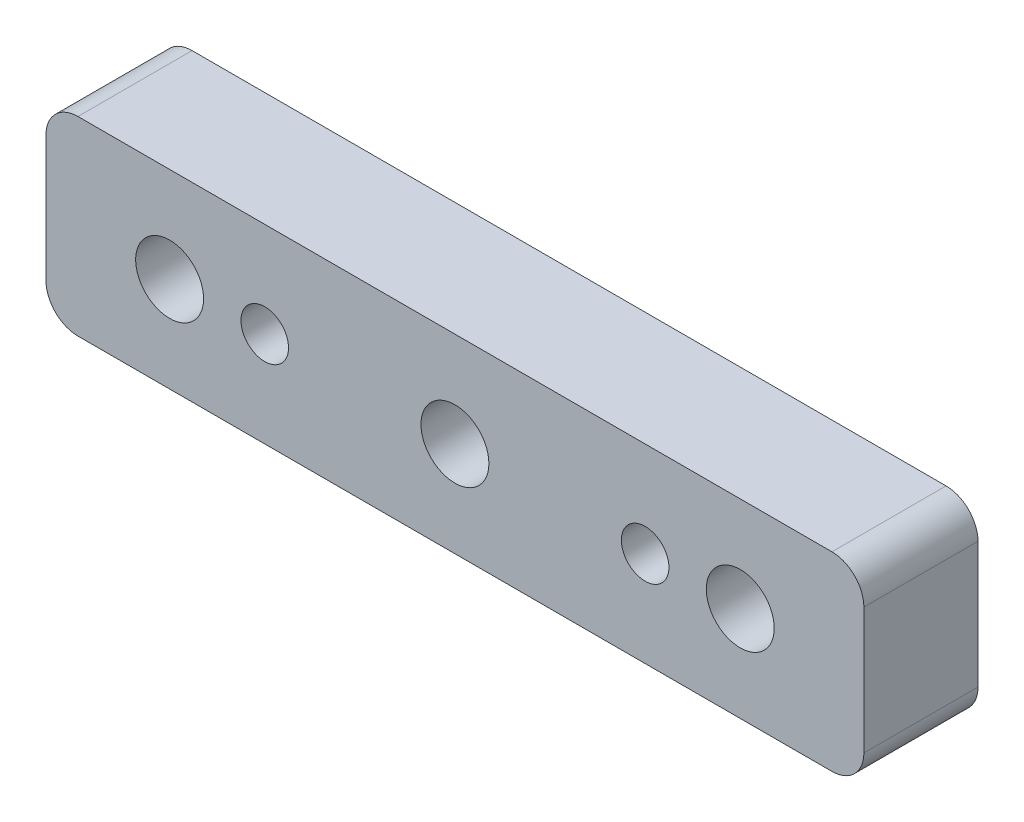
ISO-10303-21;
HEADER;
FILE_DESCRIPTION(('STEP AP214'),'2;1');
FILE_NAME('part.step','',(''),(''),'','','');
FILE_SCHEMA(('AUTOMOTIVE_DESIGN { 1 0 10303 214 1 1 1 1 }'));
ENDSEC;
DATA;
#1=APPLICATION_CONTEXT('core data for automotive mechanical design processes');
#2=APPLICATION_PROTOCOL_DEFINITION('international standard','automotive_design',2000,#1);
#3=PRODUCT_CONTEXT('',#1,'mechanical');
#4=PRODUCT('Part','Part','',(#3));
#5=PRODUCT_RELATED_PRODUCT_CATEGORY('part','',(#4));
#6=PRODUCT_DEFINITION_FORMATION('','',#4);
#7=PRODUCT_DEFINITION_CONTEXT('part definition',#1,'design');
#8=PRODUCT_DEFINITION('design','',#6,#7);
#9=PRODUCT_DEFINITION_SHAPE('','',#8);
#10=(LENGTH_UNIT() NAMED_UNIT(*) SI_UNIT(.MILLI.,.METRE.));
#11=(NAMED_UNIT(*) PLANE_ANGLE_UNIT() SI_UNIT($,.RADIAN.));
#12=(NAMED_UNIT(*) SI_UNIT($,.STERADIAN.) SOLID_ANGLE_UNIT());
#13=UNCERTAINTY_MEASURE_WITH_UNIT(LENGTH_MEASURE(1.E-05),#10,'distance_accuracy_value','');
#14=(GEOMETRIC_REPRESENTATION_CONTEXT(3) GLOBAL_UNCERTAINTY_ASSIGNED_CONTEXT((#13)) GLOBAL_UNIT_ASSIGNED_CONTEXT((#10,
#11,#12)) REPRESENTATION_CONTEXT('',''));
#15=CARTESIAN_POINT('',(0.,0.,0.));
#16=DIRECTION('',(0.,0.,1.));
#17=DIRECTION('',(1.,0.,0.));
#18=AXIS2_PLACEMENT_3D('',#15,#16,#17);
#19=CARTESIAN_POINT('',(39.64,6.64,6.));
#20=DIRECTION('',(0.,0.,-1.));
#21=DIRECTION('',(-1.,0.,0.));
#22=AXIS2_PLACEMENT_3D('',#19,#20,#21);
#23=PLANE('',#22);
#24=CARTESIAN_POINT('',(-20.,0.,6.));
#25=DIRECTION('',(0.,0.,1.));
#26=DIRECTION('',(1.,0.,0.));
#27=AXIS2_PLACEMENT_3D('',#24,#25,#26);
#28=CIRCLE('',#27,2.5);
#29=CARTESIAN_POINT('',(-17.5,0.,6.));
#30=VERTEX_POINT('',#29);
#31=EDGE_CURVE('E193',#30,#30,#28,.T.);
#32=ORIENTED_EDGE('',*,*,#31,.F.);
#33=EDGE_LOOP('',(#32));
#34=FACE_BOUND('',#33,.T.);
#35=CARTESIAN_POINT('',(0.,0.,6.));
#36=DIRECTION('',(0.,0.,1.));
#37=DIRECTION('',(1.,0.,0.));
#38=AXIS2_PLACEMENT_3D('',#35,#36,#37);
#39=CIRCLE('',#38,3.57);
#40=CARTESIAN_POINT('',(3.57,0.,6.));
#41=VERTEX_POINT('',#40);
#42=EDGE_CURVE('E181',#41,#41,#39,.T.);
#43=ORIENTED_EDGE('',*,*,#42,.F.);
#44=EDGE_LOOP('',(#43));
#45=FACE_BOUND('',#44,.T.);
#46=CARTESIAN_POINT('',(39.64,6.64,6.));
#47=DIRECTION('',(0.,0.,1.));
#48=DIRECTION('',(-1.,0.,0.));
#49=AXIS2_PLACEMENT_3D('',#46,#47,#48);
#50=CIRCLE('',#49,3.36);
#51=CARTESIAN_POINT('',(43.,6.63999999999998,6.));
#52=VERTEX_POINT('',#51);
#53=CARTESIAN_POINT('',(39.64,10.,6.));
#54=VERTEX_POINT('',#53);
#55=EDGE_CURVE('E144',#52,#54,#50,.T.);
#56=ORIENTED_EDGE('',*,*,#55,.T.);
#57=DIRECTION('',(-1.,0.,0.));
#58=VECTOR('',#57,1.);
#59=CARTESIAN_POINT('',(-39.64,10.,6.));
#60=LINE('',#59,#58);
#61=CARTESIAN_POINT('',(-39.64,10.,6.));
#62=VERTEX_POINT('',#61);
#63=EDGE_CURVE('E92',#54,#62,#60,.T.);
#64=ORIENTED_EDGE('',*,*,#63,.T.);
#65=CARTESIAN_POINT('',(-39.64,6.64,6.));
#66=DIRECTION('',(0.,0.,1.));
#67=DIRECTION('',(-1.,0.,0.));
#68=AXIS2_PLACEMENT_3D('',#65,#66,#67);
#69=CIRCLE('',#68,3.36);
#70=CARTESIAN_POINT('',(-43.,6.63999999999998,6.));
#71=VERTEX_POINT('',#70);
#72=EDGE_CURVE('E159',#62,#71,#69,.T.);
#73=ORIENTED_EDGE('',*,*,#72,.T.);
#74=DIRECTION('',(0.,-1.,0.));
#75=VECTOR('',#74,1.);
#76=CARTESIAN_POINT('',(-43.,-6.63999999999998,6.));
#77=LINE('',#76,#75);
#78=CARTESIAN_POINT('',(-43.,-6.63999999999998,6.));
#79=VERTEX_POINT('',#78);
#80=EDGE_CURVE('E172',#71,#79,#77,.T.);
#81=ORIENTED_EDGE('',*,*,#80,.T.);
#82=CARTESIAN_POINT('',(-39.64,-6.64,6.));
#83=DIRECTION('',(0.,0.,1.));
#84=DIRECTION('',(-1.,0.,0.));
#85=AXIS2_PLACEMENT_3D('',#82,#83,#84);
#86=CIRCLE('',#85,3.36);
#87=CARTESIAN_POINT('',(-39.64,-10.,6.));
#88=VERTEX_POINT('',#87);
#89=EDGE_CURVE('E111',#79,#88,#86,.T.);
#90=ORIENTED_EDGE('',*,*,#89,.T.);
#91=DIRECTION('',(1.,0.,0.));
#92=VECTOR('',#91,1.);
#93=CARTESIAN_POINT('',(-39.64,-10.,6.));
#94=LINE('',#93,#92);
#95=CARTESIAN_POINT('',(39.64,-10.,6.));
#96=VERTEX_POINT('',#95);
#97=EDGE_CURVE('E105',#88,#96,#94,.T.);
#98=ORIENTED_EDGE('',*,*,#97,.T.);
#99=CARTESIAN_POINT('',(39.64,-6.64,6.));
#100=DIRECTION('',(0.,0.,1.));
#101=DIRECTION('',(1.,0.,0.));
#102=AXIS2_PLACEMENT_3D('',#99,#100,#101);
#103=CIRCLE('',#102,3.36);
#104=CARTESIAN_POINT('',(43.,-6.63999999999998,6.));
#105=VERTEX_POINT('',#104);
#106=EDGE_CURVE('E109',#96,#105,#103,.T.);
#107=ORIENTED_EDGE('',*,*,#106,.T.);
#108=DIRECTION('',(0.,1.,0.));
#109=VECTOR('',#108,1.);
#110=CARTESIAN_POINT('',(43.,-6.63999999999998,6.));
#111=LINE('',#110,#109);
#112=EDGE_CURVE('E49',#105,#52,#111,.T.);
#113=ORIENTED_EDGE('',*,*,#112,.T.);
#114=EDGE_LOOP('',(#56,#64,#73,#81,#90,#98,#107,#113));
#115=FACE_BOUND('',#114,.T.);
#116=CARTESIAN_POINT('',(-30.,0.,6.));
#117=DIRECTION('',(0.,0.,1.));
#118=DIRECTION('',(1.,0.,0.));
#119=AXIS2_PLACEMENT_3D('',#116,#117,#118);
#120=CIRCLE('',#119,3.57);
#121=CARTESIAN_POINT('',(-26.43,0.,6.));
#122=VERTEX_POINT('',#121);
#123=EDGE_CURVE('E133',#122,#122,#120,.T.);
#124=ORIENTED_EDGE('',*,*,#123,.F.);
#125=EDGE_LOOP('',(#124));
#126=FACE_BOUND('',#125,.T.);
#127=CARTESIAN_POINT('',(30.,0.,6.));
#128=DIRECTION('',(0.,0.,1.));
#129=DIRECTION('',(1.,0.,0.));
#130=AXIS2_PLACEMENT_3D('',#127,#128,#129);
#131=CIRCLE('',#130,3.57);
#132=CARTESIAN_POINT('',(33.57,0.,6.));
#133=VERTEX_POINT('',#132);
#134=EDGE_CURVE('E187',#133,#133,#131,.T.);
#135=ORIENTED_EDGE('',*,*,#134,.F.);
#136=EDGE_LOOP('',(#135));
#137=FACE_BOUND('',#136,.T.);
#138=CARTESIAN_POINT('',(20.,0.,6.));
#139=DIRECTION('',(0.,0.,1.));
#140=DIRECTION('',(1.,0.,0.));
#141=AXIS2_PLACEMENT_3D('',#138,#139,#140);
#142=CIRCLE('',#141,2.5);
#143=CARTESIAN_POINT('',(22.5,0.,6.));
#144=VERTEX_POINT('',#143);
#145=EDGE_CURVE('E199',#144,#144,#142,.T.);
#146=ORIENTED_EDGE('',*,*,#145,.F.);
#147=EDGE_LOOP('',(#146));
#148=FACE_BOUND('',#147,.T.);
#149=ADVANCED_FACE('F32',(#34,#45,#115,#126,#137,#148),#23,.F.);
#150=CARTESIAN_POINT('',(39.64,6.64,-6.));
#151=DIRECTION('',(0.,0.,-1.));
#152=DIRECTION('',(-1.,0.,0.));
#153=AXIS2_PLACEMENT_3D('',#150,#151,#152);
#154=PLANE('',#153);
#155=CARTESIAN_POINT('',(-20.,0.,-6.));
#156=DIRECTION('',(0.,0.,1.));
#157=DIRECTION('',(1.,0.,0.));
#158=AXIS2_PLACEMENT_3D('',#155,#156,#157);
#159=CIRCLE('',#158,2.5);
#160=CARTESIAN_POINT('',(-17.5,0.,-6.));
#161=VERTEX_POINT('',#160);
#162=EDGE_CURVE('E196',#161,#161,#159,.T.);
#163=ORIENTED_EDGE('',*,*,#162,.T.);
#164=EDGE_LOOP('',(#163));
#165=FACE_BOUND('',#164,.T.);
#166=CARTESIAN_POINT('',(0.,0.,-6.));
#167=DIRECTION('',(0.,0.,1.));
#168=DIRECTION('',(1.,0.,0.));
#169=AXIS2_PLACEMENT_3D('',#166,#167,#168);
#170=CIRCLE('',#169,3.57);
#171=CARTESIAN_POINT('',(3.57,0.,-6.));
#172=VERTEX_POINT('',#171);
#173=EDGE_CURVE('E184',#172,#172,#170,.T.);
#174=ORIENTED_EDGE('',*,*,#173,.T.);
#175=EDGE_LOOP('',(#174));
#176=FACE_BOUND('',#175,.T.);
#177=CARTESIAN_POINT('',(39.64,6.64,-6.));
#178=DIRECTION('',(0.,0.,1.));
#179=DIRECTION('',(-1.,0.,0.));
#180=AXIS2_PLACEMENT_3D('',#177,#178,#179);
#181=CIRCLE('',#180,3.36);
#182=CARTESIAN_POINT('',(43.,6.63999999999998,-6.));
#183=VERTEX_POINT('',#182);
#184=CARTESIAN_POINT('',(39.64,10.,-6.));
#185=VERTEX_POINT('',#184);
#186=EDGE_CURVE('E129',#183,#185,#181,.T.);
#187=ORIENTED_EDGE('',*,*,#186,.F.);
#188=DIRECTION('',(0.,1.,0.));
#189=VECTOR('',#188,1.);
#190=CARTESIAN_POINT('',(43.,-6.63999999999998,-6.));
#191=LINE('',#190,#189);
#192=CARTESIAN_POINT('',(43.,-6.63999999999998,-6.));
#193=VERTEX_POINT('',#192);
#194=EDGE_CURVE('E84',#193,#183,#191,.T.);
#195=ORIENTED_EDGE('',*,*,#194,.F.);
#196=CARTESIAN_POINT('',(39.64,-6.64,-6.));
#197=DIRECTION('',(0.,0.,1.));
#198=DIRECTION('',(1.,0.,0.));
#199=AXIS2_PLACEMENT_3D('',#196,#197,#198);
#200=CIRCLE('',#199,3.36);
#201=CARTESIAN_POINT('',(39.64,-10.,-6.));
#202=VERTEX_POINT('',#201);
#203=EDGE_CURVE('E78',#202,#193,#200,.T.);
#204=ORIENTED_EDGE('',*,*,#203,.F.);
#205=DIRECTION('',(1.,0.,0.));
#206=VECTOR('',#205,1.);
#207=CARTESIAN_POINT('',(-39.64,-10.,-6.));
#208=LINE('',#207,#206);
#209=CARTESIAN_POINT('',(-39.64,-10.,-6.));
#210=VERTEX_POINT('',#209);
#211=EDGE_CURVE('E119',#210,#202,#208,.T.);
#212=ORIENTED_EDGE('',*,*,#211,.F.);
#213=CARTESIAN_POINT('',(-39.64,-6.64,-6.));
#214=DIRECTION('',(0.,0.,1.));
#215=DIRECTION('',(-1.,0.,0.));
#216=AXIS2_PLACEMENT_3D('',#213,#214,#215);
#217=CIRCLE('',#216,3.36);
#218=CARTESIAN_POINT('',(-43.,-6.63999999999998,-6.));
#219=VERTEX_POINT('',#218);
#220=EDGE_CURVE('E139',#219,#210,#217,.T.);
#221=ORIENTED_EDGE('',*,*,#220,.F.);
#222=DIRECTION('',(0.,-1.,0.));
#223=VECTOR('',#222,1.);
#224=CARTESIAN_POINT('',(-43.,-6.63999999999998,-6.));
#225=LINE('',#224,#223);
#226=CARTESIAN_POINT('',(-43.,6.63999999999998,-6.));
#227=VERTEX_POINT('',#226);
#228=EDGE_CURVE('E137',#227,#219,#225,.T.);
#229=ORIENTED_EDGE('',*,*,#228,.F.);
#230=CARTESIAN_POINT('',(-39.64,6.64,-6.));
#231=DIRECTION('',(0.,0.,1.));
#232=DIRECTION('',(-1.,0.,0.));
#233=AXIS2_PLACEMENT_3D('',#230,#231,#232);
#234=CIRCLE('',#233,3.36);
#235=CARTESIAN_POINT('',(-39.64,10.,-6.));
#236=VERTEX_POINT('',#235);
#237=EDGE_CURVE('E135',#236,#227,#234,.T.);
#238=ORIENTED_EDGE('',*,*,#237,.F.);
#239=DIRECTION('',(-1.,0.,0.));
#240=VECTOR('',#239,1.);
#241=CARTESIAN_POINT('',(-39.64,10.,-6.));
#242=LINE('',#241,#240);
#243=EDGE_CURVE('E132',#185,#236,#242,.T.);
#244=ORIENTED_EDGE('',*,*,#243,.F.);
#245=EDGE_LOOP('',(#187,#195,#204,#212,#221,#229,#238,#244));
#246=FACE_BOUND('',#245,.T.);
#247=CARTESIAN_POINT('',(-30.,0.,-6.));
#248=DIRECTION('',(0.,0.,1.));
#249=DIRECTION('',(1.,0.,0.));
#250=AXIS2_PLACEMENT_3D('',#247,#248,#249);
#251=CIRCLE('',#250,3.57);
#252=CARTESIAN_POINT('',(-26.43,0.,-6.));
#253=VERTEX_POINT('',#252);
#254=EDGE_CURVE('E178',#253,#253,#251,.T.);
#255=ORIENTED_EDGE('',*,*,#254,.T.);
#256=EDGE_LOOP('',(#255));
#257=FACE_BOUND('',#256,.T.);
#258=CARTESIAN_POINT('',(30.,0.,-6.));
#259=DIRECTION('',(0.,0.,1.));
#260=DIRECTION('',(1.,0.,0.));
#261=AXIS2_PLACEMENT_3D('',#258,#259,#260);
#262=CIRCLE('',#261,3.57);
#263=CARTESIAN_POINT('',(33.57,0.,-6.));
#264=VERTEX_POINT('',#263);
#265=EDGE_CURVE('E190',#264,#264,#262,.T.);
#266=ORIENTED_EDGE('',*,*,#265,.T.);
#267=EDGE_LOOP('',(#266));
#268=FACE_BOUND('',#267,.T.);
#269=CARTESIAN_POINT('',(20.,0.,-6.));
#270=DIRECTION('',(0.,0.,1.));
#271=DIRECTION('',(1.,0.,0.));
#272=AXIS2_PLACEMENT_3D('',#269,#270,#271);
#273=CIRCLE('',#272,2.5);
#274=CARTESIAN_POINT('',(22.5,0.,-6.));
#275=VERTEX_POINT('',#274);
#276=EDGE_CURVE('E202',#275,#275,#273,.T.);
#277=ORIENTED_EDGE('',*,*,#276,.T.);
#278=EDGE_LOOP('',(#277));
#279=FACE_BOUND('',#278,.T.);
#280=ADVANCED_FACE('F163',(#165,#176,#246,#257,#268,#279),#154,.T.);
#281=CARTESIAN_POINT('',(39.64,6.64,6.));
#282=DIRECTION('',(0.,0.,-1.));
#283=DIRECTION('',(-1.,0.,0.));
#284=AXIS2_PLACEMENT_3D('',#281,#282,#283);
#285=CYLINDRICAL_SURFACE('',#284,3.36);
#286=ORIENTED_EDGE('',*,*,#186,.T.);
#287=DIRECTION('',(0.,0.,-1.));
#288=VECTOR('',#287,1.);
#289=CARTESIAN_POINT('',(39.64,10.,6.));
#290=LINE('',#289,#288);
#291=EDGE_CURVE('E11',#54,#185,#290,.T.);
#292=ORIENTED_EDGE('',*,*,#291,.F.);
#293=ORIENTED_EDGE('',*,*,#55,.F.);
#294=DIRECTION('',(0.,0.,-1.));
#295=VECTOR('',#294,1.);
#296=CARTESIAN_POINT('',(43.,6.63999999999998,6.));
#297=LINE('',#296,#295);
#298=EDGE_CURVE('E125',#52,#183,#297,.T.);
#299=ORIENTED_EDGE('',*,*,#298,.T.);
#300=EDGE_LOOP('',(#286,#292,#293,#299));
#301=FACE_BOUND('',#300,.T.);
#302=ADVANCED_FACE('F34',(#301),#285,.T.);
#303=CARTESIAN_POINT('',(-39.64,10.,6.));
#304=DIRECTION('',(0.,-1.,0.));
#305=DIRECTION('',(0.,0.,-1.));
#306=AXIS2_PLACEMENT_3D('',#303,#304,#305);
#307=PLANE('',#306);
#308=ORIENTED_EDGE('',*,*,#243,.T.);
#309=DIRECTION('',(0.,0.,-1.));
#310=VECTOR('',#309,1.);
#311=CARTESIAN_POINT('',(-39.64,10.,6.));
#312=LINE('',#311,#310);
#313=EDGE_CURVE('E41',#62,#236,#312,.T.);
#314=ORIENTED_EDGE('',*,*,#313,.F.);
#315=ORIENTED_EDGE('',*,*,#63,.F.);
#316=ORIENTED_EDGE('',*,*,#291,.T.);
#317=EDGE_LOOP('',(#308,#314,#315,#316));
#318=FACE_BOUND('',#317,.T.);
#319=ADVANCED_FACE('F237',(#318),#307,.F.);
#320=CARTESIAN_POINT('',(-39.64,6.64,6.));
#321=DIRECTION('',(0.,0.,-1.));
#322=DIRECTION('',(-1.,0.,0.));
#323=AXIS2_PLACEMENT_3D('',#320,#321,#322);
#324=CYLINDRICAL_SURFACE('',#323,3.36);
#325=ORIENTED_EDGE('',*,*,#237,.T.);
#326=DIRECTION('',(0.,0.,-1.));
#327=VECTOR('',#326,1.);
#328=CARTESIAN_POINT('',(-43.,6.63999999999998,6.));
#329=LINE('',#328,#327);
#330=EDGE_CURVE('E151',#71,#227,#329,.T.);
#331=ORIENTED_EDGE('',*,*,#330,.F.);
#332=ORIENTED_EDGE('',*,*,#72,.F.);
#333=ORIENTED_EDGE('',*,*,#313,.T.);
#334=EDGE_LOOP('',(#325,#331,#332,#333));
#335=FACE_BOUND('',#334,.T.);
#336=ADVANCED_FACE('F157',(#335),#324,.T.);
#337=CARTESIAN_POINT('',(-43.,-6.63999999999998,6.));
#338=DIRECTION('',(1.,0.,0.));
#339=DIRECTION('',(0.,0.,-1.));
#340=AXIS2_PLACEMENT_3D('',#337,#338,#339);
#341=PLANE('',#340);
#342=ORIENTED_EDGE('',*,*,#228,.T.);
#343=DIRECTION('',(0.,0.,-1.));
#344=VECTOR('',#343,1.);
#345=CARTESIAN_POINT('',(-43.,-6.63999999999998,6.));
#346=LINE('',#345,#344);
#347=EDGE_CURVE('E148',#79,#219,#346,.T.);
#348=ORIENTED_EDGE('',*,*,#347,.F.);
#349=ORIENTED_EDGE('',*,*,#80,.F.);
#350=ORIENTED_EDGE('',*,*,#330,.T.);
#351=EDGE_LOOP('',(#342,#348,#349,#350));
#352=FACE_BOUND('',#351,.T.);
#353=ADVANCED_FACE('F168',(#352),#341,.F.);
#354=CARTESIAN_POINT('',(-39.64,-6.64,6.));
#355=DIRECTION('',(0.,0.,-1.));
#356=DIRECTION('',(-1.,0.,0.));
#357=AXIS2_PLACEMENT_3D('',#354,#355,#356);
#358=CYLINDRICAL_SURFACE('',#357,3.36);
#359=ORIENTED_EDGE('',*,*,#220,.T.);
#360=DIRECTION('',(0.,0.,-1.));
#361=VECTOR('',#360,1.);
#362=CARTESIAN_POINT('',(-39.64,-10.,6.));
#363=LINE('',#362,#361);
#364=EDGE_CURVE('E120',#88,#210,#363,.T.);
#365=ORIENTED_EDGE('',*,*,#364,.F.);
#366=ORIENTED_EDGE('',*,*,#89,.F.);
#367=ORIENTED_EDGE('',*,*,#347,.T.);
#368=EDGE_LOOP('',(#359,#365,#366,#367));
#369=FACE_BOUND('',#368,.T.);
#370=ADVANCED_FACE('F171',(#369),#358,.T.);
#371=CARTESIAN_POINT('',(-39.64,-10.,6.));
#372=DIRECTION('',(0.,1.,0.));
#373=DIRECTION('',(0.,0.,1.));
#374=AXIS2_PLACEMENT_3D('',#371,#372,#373);
#375=PLANE('',#374);
#376=ORIENTED_EDGE('',*,*,#211,.T.);
#377=DIRECTION('',(0.,0.,-1.));
#378=VECTOR('',#377,1.);
#379=CARTESIAN_POINT('',(39.64,-10.,6.));
#380=LINE('',#379,#378);
#381=EDGE_CURVE('E116',#96,#202,#380,.T.);
#382=ORIENTED_EDGE('',*,*,#381,.F.);
#383=ORIENTED_EDGE('',*,*,#97,.F.);
#384=ORIENTED_EDGE('',*,*,#364,.T.);
#385=EDGE_LOOP('',(#376,#382,#383,#384));
#386=FACE_BOUND('',#385,.T.);
#387=ADVANCED_FACE('F117',(#386),#375,.F.);
#388=CARTESIAN_POINT('',(39.64,-6.64,6.));
#389=DIRECTION('',(0.,0.,-1.));
#390=DIRECTION('',(-1.,0.,0.));
#391=AXIS2_PLACEMENT_3D('',#388,#389,#390);
#392=CYLINDRICAL_SURFACE('',#391,3.36);
#393=ORIENTED_EDGE('',*,*,#203,.T.);
#394=DIRECTION('',(0.,0.,-1.));
#395=VECTOR('',#394,1.);
#396=CARTESIAN_POINT('',(43.,-6.63999999999998,6.));
#397=LINE('',#396,#395);
#398=EDGE_CURVE('E121',#105,#193,#397,.T.);
#399=ORIENTED_EDGE('',*,*,#398,.F.);
#400=ORIENTED_EDGE('',*,*,#106,.F.);
#401=ORIENTED_EDGE('',*,*,#381,.T.);
#402=EDGE_LOOP('',(#393,#399,#400,#401));
#403=FACE_BOUND('',#402,.T.);
#404=ADVANCED_FACE('F123',(#403),#392,.T.);
#405=CARTESIAN_POINT('',(43.,-6.63999999999998,6.));
#406=DIRECTION('',(-1.,0.,0.));
#407=DIRECTION('',(0.,0.,1.));
#408=AXIS2_PLACEMENT_3D('',#405,#406,#407);
#409=PLANE('',#408);
#410=ORIENTED_EDGE('',*,*,#194,.T.);
#411=ORIENTED_EDGE('',*,*,#298,.F.);
#412=ORIENTED_EDGE('',*,*,#112,.F.);
#413=ORIENTED_EDGE('',*,*,#398,.T.);
#414=EDGE_LOOP('',(#410,#411,#412,#413));
#415=FACE_BOUND('',#414,.T.);
#416=ADVANCED_FACE('F225',(#415),#409,.F.);
#417=CARTESIAN_POINT('',(-30.,0.,6.));
#418=DIRECTION('',(0.,0.,-1.));
#419=DIRECTION('',(-1.,0.,0.));
#420=AXIS2_PLACEMENT_3D('',#417,#418,#419);
#421=CYLINDRICAL_SURFACE('',#420,3.57);
#422=ORIENTED_EDGE('',*,*,#123,.T.);
#423=EDGE_LOOP('',(#422));
#424=FACE_BOUND('',#423,.T.);
#425=ORIENTED_EDGE('',*,*,#254,.F.);
#426=EDGE_LOOP('',(#425));
#427=FACE_BOUND('',#426,.T.);
#428=ADVANCED_FACE('F222',(#424,#427),#421,.F.);
#429=CARTESIAN_POINT('',(0.,0.,6.));
#430=DIRECTION('',(0.,0.,-1.));
#431=DIRECTION('',(-1.,0.,0.));
#432=AXIS2_PLACEMENT_3D('',#429,#430,#431);
#433=CYLINDRICAL_SURFACE('',#432,3.57);
#434=ORIENTED_EDGE('',*,*,#42,.T.);
#435=EDGE_LOOP('',(#434));
#436=FACE_BOUND('',#435,.T.);
#437=ORIENTED_EDGE('',*,*,#173,.F.);
#438=EDGE_LOOP('',(#437));
#439=FACE_BOUND('',#438,.T.);
#440=ADVANCED_FACE('F301',(#436,#439),#433,.F.);
#441=CARTESIAN_POINT('',(30.,0.,6.));
#442=DIRECTION('',(0.,0.,-1.));
#443=DIRECTION('',(-1.,0.,0.));
#444=AXIS2_PLACEMENT_3D('',#441,#442,#443);
#445=CYLINDRICAL_SURFACE('',#444,3.57);
#446=ORIENTED_EDGE('',*,*,#134,.T.);
#447=EDGE_LOOP('',(#446));
#448=FACE_BOUND('',#447,.T.);
#449=ORIENTED_EDGE('',*,*,#265,.F.);
#450=EDGE_LOOP('',(#449));
#451=FACE_BOUND('',#450,.T.);
#452=ADVANCED_FACE('F309',(#448,#451),#445,.F.);
#453=CARTESIAN_POINT('',(-20.,0.,6.));
#454=DIRECTION('',(0.,0.,-1.));
#455=DIRECTION('',(-1.,0.,0.));
#456=AXIS2_PLACEMENT_3D('',#453,#454,#455);
#457=CYLINDRICAL_SURFACE('',#456,2.5);
#458=ORIENTED_EDGE('',*,*,#31,.T.);
#459=EDGE_LOOP('',(#458));
#460=FACE_BOUND('',#459,.T.);
#461=ORIENTED_EDGE('',*,*,#162,.F.);
#462=EDGE_LOOP('',(#461));
#463=FACE_BOUND('',#462,.T.);
#464=ADVANCED_FACE('F317',(#460,#463),#457,.F.);
#465=CARTESIAN_POINT('',(20.,0.,6.));
#466=DIRECTION('',(0.,0.,-1.));
#467=DIRECTION('',(-1.,0.,0.));
#468=AXIS2_PLACEMENT_3D('',#465,#466,#467);
#469=CYLINDRICAL_SURFACE('',#468,2.5);
#470=ORIENTED_EDGE('',*,*,#145,.T.);
#471=EDGE_LOOP('',(#470));
#472=FACE_BOUND('',#471,.T.);
#473=ORIENTED_EDGE('',*,*,#276,.F.);
#474=EDGE_LOOP('',(#473));
#475=FACE_BOUND('',#474,.T.);
#476=ADVANCED_FACE('F208',(#472,#475),#469,.F.);
#477=CLOSED_SHELL('',(#149,#280,#302,#319,#336,#353,#370,#387,#404,#416,#428,#440,#452,#464,#476));
#478=MANIFOLD_SOLID_BREP('B2',#477);
#479=ADVANCED_BREP_SHAPE_REPRESENTATION('',(#18,#478),#14);
#480=SHAPE_DEFINITION_REPRESENTATION(#9,#479);
ENDSEC;
END-ISO-10303-21;
